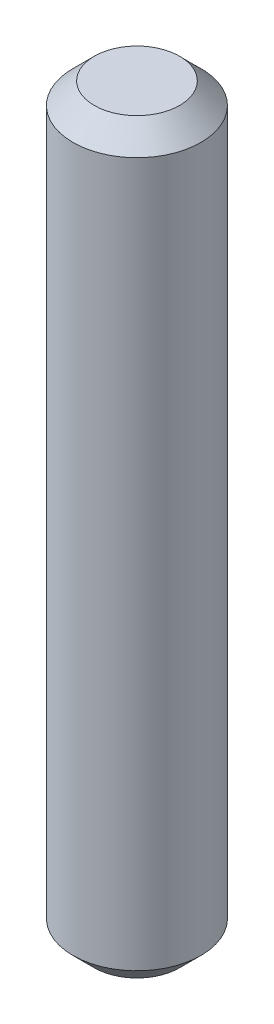
ISO-10303-21;
HEADER;
FILE_DESCRIPTION(('STEP AP214'),'2;1');
FILE_NAME('part.step','',(''),(''),'','','');
FILE_SCHEMA(('AUTOMOTIVE_DESIGN { 1 0 10303 214 1 1 1 1 }'));
ENDSEC;
DATA;
#1=APPLICATION_CONTEXT('core data for automotive mechanical design processes');
#2=APPLICATION_PROTOCOL_DEFINITION('international standard','automotive_design',2000,#1);
#3=PRODUCT_CONTEXT('',#1,'mechanical');
#4=PRODUCT('Part','Part','',(#3));
#5=PRODUCT_RELATED_PRODUCT_CATEGORY('part','',(#4));
#6=PRODUCT_DEFINITION_FORMATION('','',#4);
#7=PRODUCT_DEFINITION_CONTEXT('part definition',#1,'design');
#8=PRODUCT_DEFINITION('design','',#6,#7);
#9=PRODUCT_DEFINITION_SHAPE('','',#8);
#10=(LENGTH_UNIT() NAMED_UNIT(*) SI_UNIT(.MILLI.,.METRE.));
#11=(NAMED_UNIT(*) PLANE_ANGLE_UNIT() SI_UNIT($,.RADIAN.));
#12=(NAMED_UNIT(*) SI_UNIT($,.STERADIAN.) SOLID_ANGLE_UNIT());
#13=UNCERTAINTY_MEASURE_WITH_UNIT(LENGTH_MEASURE(1.E-05),#10,'distance_accuracy_value','');
#14=(GEOMETRIC_REPRESENTATION_CONTEXT(3) GLOBAL_UNCERTAINTY_ASSIGNED_CONTEXT((#13)) GLOBAL_UNIT_ASSIGNED_CONTEXT((#10,
#11,#12)) REPRESENTATION_CONTEXT('',''));
#15=CARTESIAN_POINT('',(0.,0.,0.));
#16=DIRECTION('',(0.,0.,1.));
#17=DIRECTION('',(1.,0.,0.));
#18=AXIS2_PLACEMENT_3D('',#15,#16,#17);
#19=CARTESIAN_POINT('',(0.,70.,0.));
#20=DIRECTION('',(0.,-1.,0.));
#21=DIRECTION('',(0.,0.,-1.));
#22=AXIS2_PLACEMENT_3D('',#19,#20,#21);
#23=CYLINDRICAL_SURFACE('',#22,6.);
#24=CARTESIAN_POINT('',(0.,2.,0.));
#25=DIRECTION('',(0.,1.,0.));
#26=DIRECTION('',(0.,0.,1.));
#27=AXIS2_PLACEMENT_3D('',#24,#25,#26);
#28=CIRCLE('',#27,6.);
#29=CARTESIAN_POINT('',(0.,2.,6.));
#30=VERTEX_POINT('',#29);
#31=EDGE_CURVE('E60',#30,#30,#28,.T.);
#32=ORIENTED_EDGE('',*,*,#31,.T.);
#33=EDGE_LOOP('',(#32));
#34=FACE_BOUND('',#33,.T.);
#35=CARTESIAN_POINT('',(0.,68.,0.));
#36=DIRECTION('',(0.,1.,0.));
#37=DIRECTION('',(0.,0.,1.));
#38=AXIS2_PLACEMENT_3D('',#35,#36,#37);
#39=CIRCLE('',#38,6.);
#40=CARTESIAN_POINT('',(0.,68.,6.));
#41=VERTEX_POINT('',#40);
#42=EDGE_CURVE('E64',#41,#41,#39,.F.);
#43=ORIENTED_EDGE('',*,*,#42,.T.);
#44=EDGE_LOOP('',(#43));
#45=FACE_BOUND('',#44,.T.);
#46=ADVANCED_FACE('F48',(#34,#45),#23,.T.);
#47=CARTESIAN_POINT('',(0.,70.,0.));
#48=DIRECTION('',(0.,1.,0.));
#49=DIRECTION('',(0.,0.,1.));
#50=AXIS2_PLACEMENT_3D('',#47,#48,#49);
#51=PLANE('',#50);
#52=CARTESIAN_POINT('',(0.,70.,0.));
#53=DIRECTION('',(0.,1.,0.));
#54=DIRECTION('',(0.,0.,1.));
#55=AXIS2_PLACEMENT_3D('',#52,#53,#54);
#56=CIRCLE('',#55,4.);
#57=CARTESIAN_POINT('',(0.,70.,4.));
#58=VERTEX_POINT('',#57);
#59=EDGE_CURVE('E10',#58,#58,#56,.T.);
#60=ORIENTED_EDGE('',*,*,#59,.T.);
#61=EDGE_LOOP('',(#60));
#62=FACE_BOUND('',#61,.T.);
#63=ADVANCED_FACE('F80',(#62),#51,.T.);
#64=CARTESIAN_POINT('',(0.,0.,0.));
#65=DIRECTION('',(0.,1.,0.));
#66=DIRECTION('',(0.,0.,1.));
#67=AXIS2_PLACEMENT_3D('',#64,#65,#66);
#68=PLANE('',#67);
#69=CARTESIAN_POINT('',(0.,0.,0.));
#70=DIRECTION('',(0.,1.,0.));
#71=DIRECTION('',(0.,0.,1.));
#72=AXIS2_PLACEMENT_3D('',#69,#70,#71);
#73=CIRCLE('',#72,3.99999999999999);
#74=CARTESIAN_POINT('',(0.,0.,3.99999999999999));
#75=VERTEX_POINT('',#74);
#76=EDGE_CURVE('E56',#75,#75,#73,.F.);
#77=ORIENTED_EDGE('',*,*,#76,.T.);
#78=EDGE_LOOP('',(#77));
#79=FACE_BOUND('',#78,.T.);
#80=ADVANCED_FACE('F77',(#79),#68,.F.);
#81=CARTESIAN_POINT('',(0.,2.,0.));
#82=DIRECTION('',(0.,1.,0.));
#83=DIRECTION('',(0.,0.,1.));
#84=AXIS2_PLACEMENT_3D('',#81,#82,#83);
#85=CONICAL_SURFACE('',#84,6.,0.78539816339745);
#86=ORIENTED_EDGE('',*,*,#76,.F.);
#87=EDGE_LOOP('',(#86));
#88=FACE_BOUND('',#87,.T.);
#89=ORIENTED_EDGE('',*,*,#31,.F.);
#90=EDGE_LOOP('',(#89));
#91=FACE_BOUND('',#90,.T.);
#92=ADVANCED_FACE('F73',(#88,#91),#85,.T.);
#93=CARTESIAN_POINT('',(0.,70.,0.));
#94=DIRECTION('',(0.,-1.,0.));
#95=DIRECTION('',(0.,0.,-1.));
#96=AXIS2_PLACEMENT_3D('',#93,#94,#95);
#97=CONICAL_SURFACE('',#96,4.,0.785398163397449);
#98=ORIENTED_EDGE('',*,*,#42,.F.);
#99=EDGE_LOOP('',(#98));
#100=FACE_BOUND('',#99,.T.);
#101=ORIENTED_EDGE('',*,*,#59,.F.);
#102=EDGE_LOOP('',(#101));
#103=FACE_BOUND('',#102,.T.);
#104=ADVANCED_FACE('F51',(#100,#103),#97,.T.);
#105=CLOSED_SHELL('',(#46,#63,#80,#92,#104));
#106=MANIFOLD_SOLID_BREP('B2',#105);
#107=ADVANCED_BREP_SHAPE_REPRESENTATION('',(#18,#106),#14);
#108=SHAPE_DEFINITION_REPRESENTATION(#9,#107);
ENDSEC;
END-ISO-10303-21;
